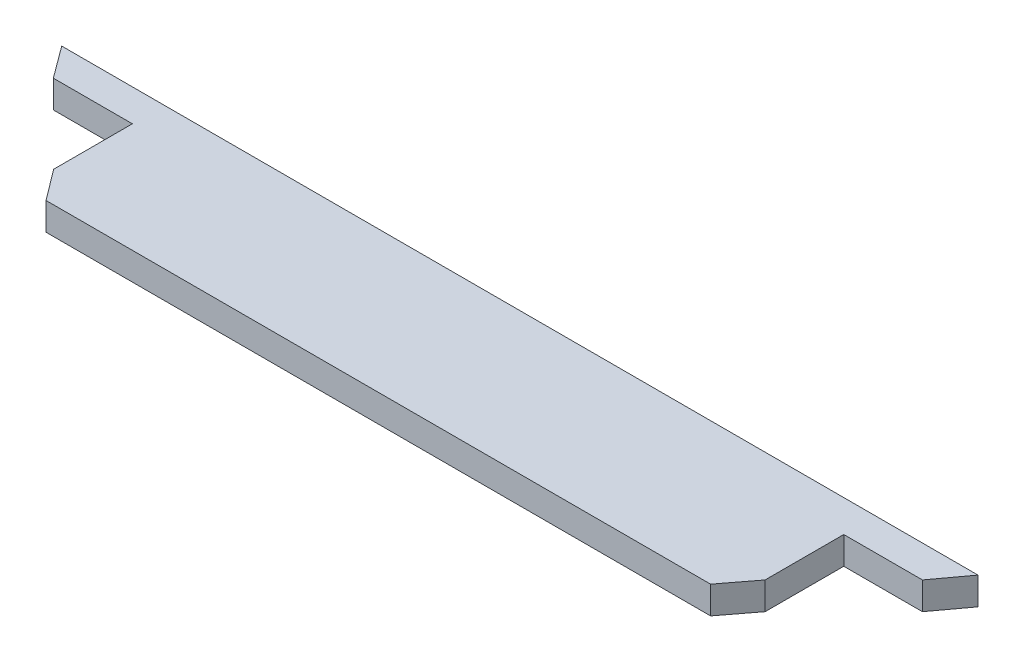
ISO-10303-21;
HEADER;
FILE_DESCRIPTION(('STEP AP214'),'2;1');
FILE_NAME('part.step','',(''),(''),'','','');
FILE_SCHEMA(('AUTOMOTIVE_DESIGN { 1 0 10303 214 1 1 1 1 }'));
ENDSEC;
DATA;
#1=APPLICATION_CONTEXT('core data for automotive mechanical design processes');
#2=APPLICATION_PROTOCOL_DEFINITION('international standard','automotive_design',2000,#1);
#3=PRODUCT_CONTEXT('',#1,'mechanical');
#4=PRODUCT('Part','Part','',(#3));
#5=PRODUCT_RELATED_PRODUCT_CATEGORY('part','',(#4));
#6=PRODUCT_DEFINITION_FORMATION('','',#4);
#7=PRODUCT_DEFINITION_CONTEXT('part definition',#1,'design');
#8=PRODUCT_DEFINITION('design','',#6,#7);
#9=PRODUCT_DEFINITION_SHAPE('','',#8);
#10=(LENGTH_UNIT() NAMED_UNIT(*) SI_UNIT(.MILLI.,.METRE.));
#11=(NAMED_UNIT(*) PLANE_ANGLE_UNIT() SI_UNIT($,.RADIAN.));
#12=(NAMED_UNIT(*) SI_UNIT($,.STERADIAN.) SOLID_ANGLE_UNIT());
#13=UNCERTAINTY_MEASURE_WITH_UNIT(LENGTH_MEASURE(1.E-05),#10,'distance_accuracy_value','');
#14=(GEOMETRIC_REPRESENTATION_CONTEXT(3) GLOBAL_UNCERTAINTY_ASSIGNED_CONTEXT((#13)) GLOBAL_UNIT_ASSIGNED_CONTEXT((#10,
#11,#12)) REPRESENTATION_CONTEXT('',''));
#15=CARTESIAN_POINT('',(0.,0.,0.));
#16=DIRECTION('',(0.,0.,1.));
#17=DIRECTION('',(1.,0.,0.));
#18=AXIS2_PLACEMENT_3D('',#15,#16,#17);
#19=CARTESIAN_POINT('',(-1166.00063908424,70.,-32.2730036511127));
#20=DIRECTION('',(0.804757525410086,0.,-0.593603676956127));
#21=DIRECTION('',(-0.593603676956127,0.,-0.804757525410086));
#22=AXIS2_PLACEMENT_3D('',#19,#20,#21);
#23=PLANE('',#22);
#24=DIRECTION('',(0.593603676956127,0.,0.804757525410086));
#25=VECTOR('',#24,1.);
#26=CARTESIAN_POINT('',(-1166.00063908424,0.,-32.2730036511127));
#27=LINE('',#26,#25);
#28=CARTESIAN_POINT('',(-1226.00063908424,0.,-113.615915427204));
#29=VERTEX_POINT('',#28);
#30=CARTESIAN_POINT('',(-1166.00063908424,0.,-32.2730036511127));
#31=VERTEX_POINT('',#30);
#32=EDGE_CURVE('E143',#29,#31,#27,.T.);
#33=ORIENTED_EDGE('',*,*,#32,.T.);
#34=DIRECTION('',(0.,-1.,0.));
#35=VECTOR('',#34,1.);
#36=CARTESIAN_POINT('',(-1166.00063908424,70.,-32.2730036511127));
#37=LINE('',#36,#35);
#38=CARTESIAN_POINT('',(-1166.00063908424,70.,-32.2730036511127));
#39=VERTEX_POINT('',#38);
#40=EDGE_CURVE('E11',#39,#31,#37,.T.);
#41=ORIENTED_EDGE('',*,*,#40,.F.);
#42=DIRECTION('',(0.593603676956127,0.,0.804757525410086));
#43=VECTOR('',#42,1.);
#44=CARTESIAN_POINT('',(-1166.00063908424,70.,-32.2730036511127));
#45=LINE('',#44,#43);
#46=CARTESIAN_POINT('',(-1226.00063908424,70.,-113.615915427204));
#47=VERTEX_POINT('',#46);
#48=EDGE_CURVE('E161',#47,#39,#45,.T.);
#49=ORIENTED_EDGE('',*,*,#48,.F.);
#50=DIRECTION('',(0.,-1.,0.));
#51=VECTOR('',#50,1.);
#52=CARTESIAN_POINT('',(-1226.00063908424,70.,-113.615915427204));
#53=LINE('',#52,#51);
#54=EDGE_CURVE('E139',#47,#29,#53,.T.);
#55=ORIENTED_EDGE('',*,*,#54,.T.);
#56=EDGE_LOOP('',(#33,#41,#49,#55));
#57=FACE_BOUND('',#56,.T.);
#58=ADVANCED_FACE('F35',(#57),#23,.F.);
#59=CARTESIAN_POINT('',(-965.035064759479,70.,-32.273003651113));
#60=DIRECTION('',(0.,0.,-1.));
#61=DIRECTION('',(-1.,0.,0.));
#62=AXIS2_PLACEMENT_3D('',#59,#60,#61);
#63=PLANE('',#62);
#64=DIRECTION('',(1.,0.,0.));
#65=VECTOR('',#64,1.);
#66=CARTESIAN_POINT('',(-965.035064759479,0.,-32.273003651113));
#67=LINE('',#66,#65);
#68=CARTESIAN_POINT('',(-965.035064759479,0.,-32.273003651113));
#69=VERTEX_POINT('',#68);
#70=EDGE_CURVE('E146',#31,#69,#67,.T.);
#71=ORIENTED_EDGE('',*,*,#70,.T.);
#72=DIRECTION('',(0.,-1.,0.));
#73=VECTOR('',#72,1.);
#74=CARTESIAN_POINT('',(-965.035064759479,70.,-32.273003651113));
#75=LINE('',#74,#73);
#76=CARTESIAN_POINT('',(-965.035064759479,70.,-32.273003651113));
#77=VERTEX_POINT('',#76);
#78=EDGE_CURVE('E43',#77,#69,#75,.T.);
#79=ORIENTED_EDGE('',*,*,#78,.F.);
#80=DIRECTION('',(1.,0.,0.));
#81=VECTOR('',#80,1.);
#82=CARTESIAN_POINT('',(-965.035064759479,70.,-32.273003651113));
#83=LINE('',#82,#81);
#84=EDGE_CURVE('E100',#39,#77,#83,.T.);
#85=ORIENTED_EDGE('',*,*,#84,.F.);
#86=ORIENTED_EDGE('',*,*,#40,.T.);
#87=EDGE_LOOP('',(#71,#79,#85,#86));
#88=FACE_BOUND('',#87,.T.);
#89=ADVANCED_FACE('F210',(#88),#63,.F.);
#90=CARTESIAN_POINT('',(-965.035064759479,70.,167.726996348887));
#91=DIRECTION('',(1.,0.,0.));
#92=DIRECTION('',(0.,0.,-1.));
#93=AXIS2_PLACEMENT_3D('',#90,#91,#92);
#94=PLANE('',#93);
#95=DIRECTION('',(0.,0.,1.));
#96=VECTOR('',#95,1.);
#97=CARTESIAN_POINT('',(-965.035064759479,0.,167.726996348887));
#98=LINE('',#97,#96);
#99=CARTESIAN_POINT('',(-965.035064759479,0.,167.726996348887));
#100=VERTEX_POINT('',#99);
#101=EDGE_CURVE('E148',#69,#100,#98,.T.);
#102=ORIENTED_EDGE('',*,*,#101,.T.);
#103=DIRECTION('',(0.,-1.,0.));
#104=VECTOR('',#103,1.);
#105=CARTESIAN_POINT('',(-965.035064759479,70.,167.726996348887));
#106=LINE('',#105,#104);
#107=CARTESIAN_POINT('',(-965.035064759479,70.,167.726996348887));
#108=VERTEX_POINT('',#107);
#109=EDGE_CURVE('E174',#108,#100,#106,.T.);
#110=ORIENTED_EDGE('',*,*,#109,.F.);
#111=DIRECTION('',(0.,0.,1.));
#112=VECTOR('',#111,1.);
#113=CARTESIAN_POINT('',(-965.035064759479,70.,167.726996348887));
#114=LINE('',#113,#112);
#115=EDGE_CURVE('E182',#77,#108,#114,.T.);
#116=ORIENTED_EDGE('',*,*,#115,.F.);
#117=ORIENTED_EDGE('',*,*,#78,.T.);
#118=EDGE_LOOP('',(#102,#110,#116,#117));
#119=FACE_BOUND('',#118,.T.);
#120=ADVANCED_FACE('F180',(#119),#94,.F.);
#121=CARTESIAN_POINT('',(-906.000639084243,70.,246.384084572796));
#122=DIRECTION('',(0.799796870203866,0.,-0.60027074425804));
#123=DIRECTION('',(-0.60027074425804,0.,-0.799796870203866));
#124=AXIS2_PLACEMENT_3D('',#121,#122,#123);
#125=PLANE('',#124);
#126=DIRECTION('',(0.60027074425804,0.,0.799796870203866));
#127=VECTOR('',#126,1.);
#128=CARTESIAN_POINT('',(-906.000639084243,0.,246.384084572796));
#129=LINE('',#128,#127);
#130=CARTESIAN_POINT('',(-906.000639084243,0.,246.384084572796));
#131=VERTEX_POINT('',#130);
#132=EDGE_CURVE('E150',#100,#131,#129,.T.);
#133=ORIENTED_EDGE('',*,*,#132,.T.);
#134=DIRECTION('',(0.,-1.,0.));
#135=VECTOR('',#134,1.);
#136=CARTESIAN_POINT('',(-906.000639084243,70.,246.384084572796));
#137=LINE('',#136,#135);
#138=CARTESIAN_POINT('',(-906.000639084243,70.,246.384084572796));
#139=VERTEX_POINT('',#138);
#140=EDGE_CURVE('E171',#139,#131,#137,.T.);
#141=ORIENTED_EDGE('',*,*,#140,.F.);
#142=DIRECTION('',(0.60027074425804,0.,0.799796870203866));
#143=VECTOR('',#142,1.);
#144=CARTESIAN_POINT('',(-906.000639084243,70.,246.384084572796));
#145=LINE('',#144,#143);
#146=EDGE_CURVE('E200',#108,#139,#145,.T.);
#147=ORIENTED_EDGE('',*,*,#146,.F.);
#148=ORIENTED_EDGE('',*,*,#109,.T.);
#149=EDGE_LOOP('',(#133,#141,#147,#148));
#150=FACE_BOUND('',#149,.T.);
#151=ADVANCED_FACE('F191',(#150),#125,.F.);
#152=CARTESIAN_POINT('',(783.964935240521,70.,246.384084572796));
#153=DIRECTION('',(0.,0.,-1.));
#154=DIRECTION('',(-1.,0.,0.));
#155=AXIS2_PLACEMENT_3D('',#152,#153,#154);
#156=PLANE('',#155);
#157=DIRECTION('',(1.,0.,0.));
#158=VECTOR('',#157,1.);
#159=CARTESIAN_POINT('',(783.964935240521,0.,246.384084572796));
#160=LINE('',#159,#158);
#161=CARTESIAN_POINT('',(783.964935240521,0.,246.384084572796));
#162=VERTEX_POINT('',#161);
#163=EDGE_CURVE('E152',#131,#162,#160,.T.);
#164=ORIENTED_EDGE('',*,*,#163,.T.);
#165=DIRECTION('',(0.,-1.,0.));
#166=VECTOR('',#165,1.);
#167=CARTESIAN_POINT('',(783.964935240521,70.,246.384084572796));
#168=LINE('',#167,#166);
#169=CARTESIAN_POINT('',(783.964935240521,70.,246.384084572796));
#170=VERTEX_POINT('',#169);
#171=EDGE_CURVE('E168',#170,#162,#168,.T.);
#172=ORIENTED_EDGE('',*,*,#171,.F.);
#173=DIRECTION('',(1.,0.,0.));
#174=VECTOR('',#173,1.);
#175=CARTESIAN_POINT('',(783.964935240521,70.,246.384084572796));
#176=LINE('',#175,#174);
#177=EDGE_CURVE('E197',#139,#170,#176,.T.);
#178=ORIENTED_EDGE('',*,*,#177,.F.);
#179=ORIENTED_EDGE('',*,*,#140,.T.);
#180=EDGE_LOOP('',(#164,#172,#178,#179));
#181=FACE_BOUND('',#180,.T.);
#182=ADVANCED_FACE('F195',(#181),#156,.F.);
#183=CARTESIAN_POINT('',(843.964935240521,70.,167.726996348887));
#184=DIRECTION('',(-0.795086642462581,0.,-0.606495862292217));
#185=DIRECTION('',(-0.606495862292217,0.,0.795086642462581));
#186=AXIS2_PLACEMENT_3D('',#183,#184,#185);
#187=PLANE('',#186);
#188=DIRECTION('',(0.606495862292217,0.,-0.795086642462581));
#189=VECTOR('',#188,1.);
#190=CARTESIAN_POINT('',(843.964935240521,0.,167.726996348887));
#191=LINE('',#190,#189);
#192=CARTESIAN_POINT('',(843.964935240521,0.,167.726996348887));
#193=VERTEX_POINT('',#192);
#194=EDGE_CURVE('E154',#162,#193,#191,.T.);
#195=ORIENTED_EDGE('',*,*,#194,.T.);
#196=DIRECTION('',(0.,-1.,0.));
#197=VECTOR('',#196,1.);
#198=CARTESIAN_POINT('',(843.964935240521,70.,167.726996348887));
#199=LINE('',#198,#197);
#200=CARTESIAN_POINT('',(843.964935240521,70.,167.726996348887));
#201=VERTEX_POINT('',#200);
#202=EDGE_CURVE('E165',#201,#193,#199,.T.);
#203=ORIENTED_EDGE('',*,*,#202,.F.);
#204=DIRECTION('',(0.606495862292217,0.,-0.795086642462581));
#205=VECTOR('',#204,1.);
#206=CARTESIAN_POINT('',(843.964935240521,70.,167.726996348887));
#207=LINE('',#206,#205);
#208=EDGE_CURVE('E199',#170,#201,#207,.T.);
#209=ORIENTED_EDGE('',*,*,#208,.F.);
#210=ORIENTED_EDGE('',*,*,#171,.T.);
#211=EDGE_LOOP('',(#195,#203,#209,#210));
#212=FACE_BOUND('',#211,.T.);
#213=ADVANCED_FACE('F222',(#212),#187,.F.);
#214=CARTESIAN_POINT('',(843.964935240521,70.,-32.273003651113));
#215=DIRECTION('',(-1.,0.,0.));
#216=DIRECTION('',(0.,0.,1.));
#217=AXIS2_PLACEMENT_3D('',#214,#215,#216);
#218=PLANE('',#217);
#219=DIRECTION('',(0.,0.,-1.));
#220=VECTOR('',#219,1.);
#221=CARTESIAN_POINT('',(843.964935240521,0.,-32.273003651113));
#222=LINE('',#221,#220);
#223=CARTESIAN_POINT('',(843.964935240521,0.,-32.273003651113));
#224=VERTEX_POINT('',#223);
#225=EDGE_CURVE('E156',#193,#224,#222,.T.);
#226=ORIENTED_EDGE('',*,*,#225,.T.);
#227=DIRECTION('',(0.,-1.,0.));
#228=VECTOR('',#227,1.);
#229=CARTESIAN_POINT('',(843.964935240521,70.,-32.273003651113));
#230=LINE('',#229,#228);
#231=CARTESIAN_POINT('',(843.964935240521,70.,-32.273003651113));
#232=VERTEX_POINT('',#231);
#233=EDGE_CURVE('E134',#232,#224,#230,.T.);
#234=ORIENTED_EDGE('',*,*,#233,.F.);
#235=DIRECTION('',(0.,0.,-1.));
#236=VECTOR('',#235,1.);
#237=CARTESIAN_POINT('',(843.964935240521,70.,-32.273003651113));
#238=LINE('',#237,#236);
#239=EDGE_CURVE('E125',#201,#232,#238,.T.);
#240=ORIENTED_EDGE('',*,*,#239,.F.);
#241=ORIENTED_EDGE('',*,*,#202,.T.);
#242=EDGE_LOOP('',(#226,#234,#240,#241));
#243=FACE_BOUND('',#242,.T.);
#244=ADVANCED_FACE('F225',(#243),#218,.F.);
#245=CARTESIAN_POINT('',(1043.96493524052,70.,-32.273003651113));
#246=DIRECTION('',(0.,0.,-1.));
#247=DIRECTION('',(-1.,0.,0.));
#248=AXIS2_PLACEMENT_3D('',#245,#246,#247);
#249=PLANE('',#248);
#250=DIRECTION('',(1.,0.,0.));
#251=VECTOR('',#250,1.);
#252=CARTESIAN_POINT('',(1043.96493524052,0.,-32.273003651113));
#253=LINE('',#252,#251);
#254=CARTESIAN_POINT('',(1043.96493524052,0.,-32.273003651113));
#255=VERTEX_POINT('',#254);
#256=EDGE_CURVE('E133',#224,#255,#253,.T.);
#257=ORIENTED_EDGE('',*,*,#256,.T.);
#258=DIRECTION('',(0.,-1.,0.));
#259=VECTOR('',#258,1.);
#260=CARTESIAN_POINT('',(1043.96493524052,70.,-32.273003651113));
#261=LINE('',#260,#259);
#262=CARTESIAN_POINT('',(1043.96493524052,70.,-32.273003651113));
#263=VERTEX_POINT('',#262);
#264=EDGE_CURVE('E130',#263,#255,#261,.T.);
#265=ORIENTED_EDGE('',*,*,#264,.F.);
#266=DIRECTION('',(1.,0.,0.));
#267=VECTOR('',#266,1.);
#268=CARTESIAN_POINT('',(1043.96493524052,70.,-32.273003651113));
#269=LINE('',#268,#267);
#270=EDGE_CURVE('E119',#232,#263,#269,.T.);
#271=ORIENTED_EDGE('',*,*,#270,.F.);
#272=ORIENTED_EDGE('',*,*,#233,.T.);
#273=EDGE_LOOP('',(#257,#265,#271,#272));
#274=FACE_BOUND('',#273,.T.);
#275=ADVANCED_FACE('F131',(#274),#249,.F.);
#276=CARTESIAN_POINT('',(1103.96493524052,70.,-113.615915427204));
#277=DIRECTION('',(-0.804757525410086,0.,-0.593603676956128));
#278=DIRECTION('',(-0.593603676956128,0.,0.804757525410086));
#279=AXIS2_PLACEMENT_3D('',#276,#277,#278);
#280=PLANE('',#279);
#281=DIRECTION('',(0.593603676956128,0.,-0.804757525410085));
#282=VECTOR('',#281,1.);
#283=CARTESIAN_POINT('',(1103.96493524052,0.,-113.615915427204));
#284=LINE('',#283,#282);
#285=CARTESIAN_POINT('',(1103.96493524052,0.,-113.615915427204));
#286=VERTEX_POINT('',#285);
#287=EDGE_CURVE('E86',#255,#286,#284,.T.);
#288=ORIENTED_EDGE('',*,*,#287,.T.);
#289=DIRECTION('',(0.,-1.,0.));
#290=VECTOR('',#289,1.);
#291=CARTESIAN_POINT('',(1103.96493524052,70.,-113.615915427204));
#292=LINE('',#291,#290);
#293=CARTESIAN_POINT('',(1103.96493524052,70.,-113.615915427204));
#294=VERTEX_POINT('',#293);
#295=EDGE_CURVE('E135',#294,#286,#292,.T.);
#296=ORIENTED_EDGE('',*,*,#295,.F.);
#297=DIRECTION('',(0.593603676956128,0.,-0.804757525410085));
#298=VECTOR('',#297,1.);
#299=CARTESIAN_POINT('',(1103.96493524052,70.,-113.615915427204));
#300=LINE('',#299,#298);
#301=EDGE_CURVE('E123',#263,#294,#300,.T.);
#302=ORIENTED_EDGE('',*,*,#301,.F.);
#303=ORIENTED_EDGE('',*,*,#264,.T.);
#304=EDGE_LOOP('',(#288,#296,#302,#303));
#305=FACE_BOUND('',#304,.T.);
#306=ADVANCED_FACE('F137',(#305),#280,.F.);
#307=CARTESIAN_POINT('',(-1226.00063908424,70.,-113.615915427204));
#308=DIRECTION('',(0.,0.,1.));
#309=DIRECTION('',(1.,0.,0.));
#310=AXIS2_PLACEMENT_3D('',#307,#308,#309);
#311=PLANE('',#310);
#312=DIRECTION('',(-1.,0.,0.));
#313=VECTOR('',#312,1.);
#314=CARTESIAN_POINT('',(-1226.00063908424,0.,-113.615915427204));
#315=LINE('',#314,#313);
#316=EDGE_CURVE('E92',#286,#29,#315,.T.);
#317=ORIENTED_EDGE('',*,*,#316,.T.);
#318=ORIENTED_EDGE('',*,*,#54,.F.);
#319=DIRECTION('',(-1.,0.,0.));
#320=VECTOR('',#319,1.);
#321=CARTESIAN_POINT('',(-1226.00063908424,70.,-113.615915427204));
#322=LINE('',#321,#320);
#323=EDGE_CURVE('E51',#294,#47,#322,.T.);
#324=ORIENTED_EDGE('',*,*,#323,.F.);
#325=ORIENTED_EDGE('',*,*,#295,.T.);
#326=EDGE_LOOP('',(#317,#318,#324,#325));
#327=FACE_BOUND('',#326,.T.);
#328=ADVANCED_FACE('F234',(#327),#311,.F.);
#329=CARTESIAN_POINT('',(0.,70.,0.));
#330=DIRECTION('',(0.,1.,0.));
#331=DIRECTION('',(0.,0.,1.));
#332=AXIS2_PLACEMENT_3D('',#329,#330,#331);
#333=PLANE('',#332);
#334=ORIENTED_EDGE('',*,*,#48,.T.);
#335=ORIENTED_EDGE('',*,*,#84,.T.);
#336=ORIENTED_EDGE('',*,*,#115,.T.);
#337=ORIENTED_EDGE('',*,*,#146,.T.);
#338=ORIENTED_EDGE('',*,*,#177,.T.);
#339=ORIENTED_EDGE('',*,*,#208,.T.);
#340=ORIENTED_EDGE('',*,*,#239,.T.);
#341=ORIENTED_EDGE('',*,*,#270,.T.);
#342=ORIENTED_EDGE('',*,*,#301,.T.);
#343=ORIENTED_EDGE('',*,*,#323,.T.);
#344=EDGE_LOOP('',(#334,#335,#336,#337,#338,#339,#340,#341,#342,#343));
#345=FACE_BOUND('',#344,.T.);
#346=ADVANCED_FACE('F121',(#345),#333,.T.);
#347=CARTESIAN_POINT('',(0.,0.,0.));
#348=DIRECTION('',(0.,1.,0.));
#349=DIRECTION('',(0.,0.,1.));
#350=AXIS2_PLACEMENT_3D('',#347,#348,#349);
#351=PLANE('',#350);
#352=ORIENTED_EDGE('',*,*,#32,.F.);
#353=ORIENTED_EDGE('',*,*,#316,.F.);
#354=ORIENTED_EDGE('',*,*,#287,.F.);
#355=ORIENTED_EDGE('',*,*,#256,.F.);
#356=ORIENTED_EDGE('',*,*,#225,.F.);
#357=ORIENTED_EDGE('',*,*,#194,.F.);
#358=ORIENTED_EDGE('',*,*,#163,.F.);
#359=ORIENTED_EDGE('',*,*,#132,.F.);
#360=ORIENTED_EDGE('',*,*,#101,.F.);
#361=ORIENTED_EDGE('',*,*,#70,.F.);
#362=EDGE_LOOP('',(#352,#353,#354,#355,#356,#357,#358,#359,#360,#361));
#363=FACE_BOUND('',#362,.T.);
#364=ADVANCED_FACE('F186',(#363),#351,.F.);
#365=CLOSED_SHELL('',(#58,#89,#120,#151,#182,#213,#244,#275,#306,#328,#346,#364));
#366=MANIFOLD_SOLID_BREP('B2',#365);
#367=ADVANCED_BREP_SHAPE_REPRESENTATION('',(#18,#366),#14);
#368=SHAPE_DEFINITION_REPRESENTATION(#9,#367);
ENDSEC;
END-ISO-10303-21;
